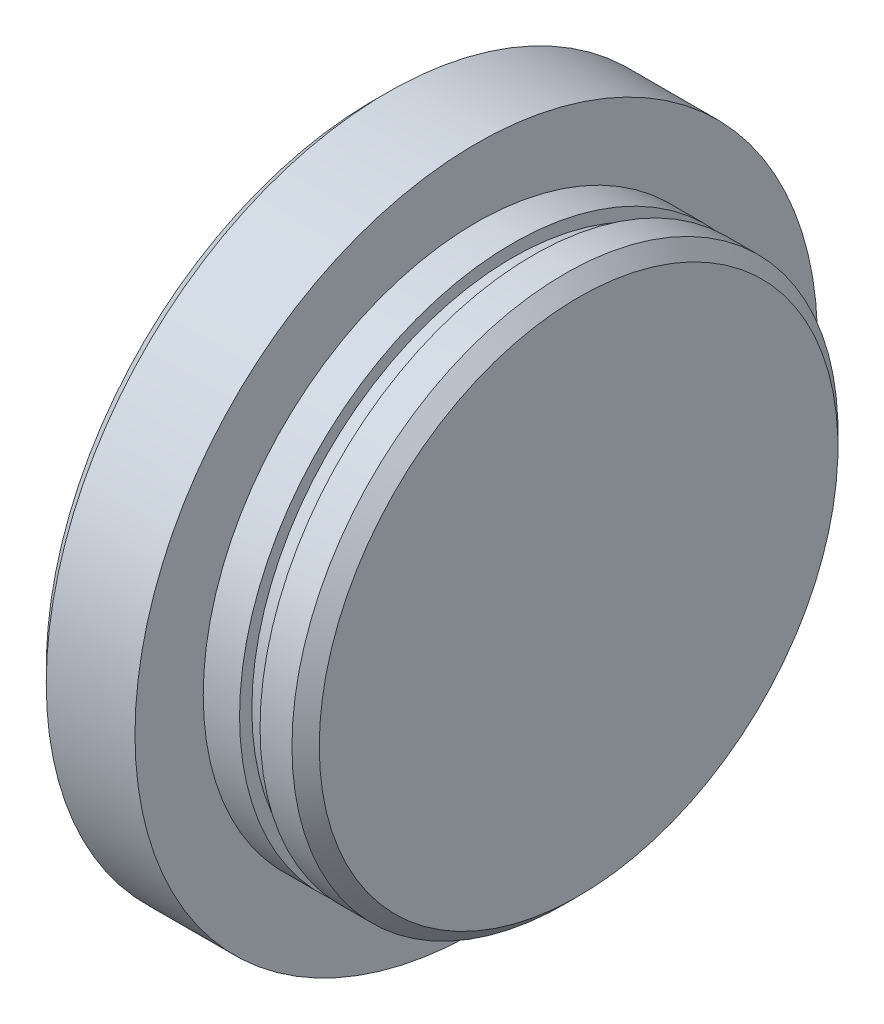
ISO-10303-21;
HEADER;
FILE_DESCRIPTION(('STEP AP214'),'2;1');
FILE_NAME('part.step','',(''),(''),'','','');
FILE_SCHEMA(('AUTOMOTIVE_DESIGN { 1 0 10303 214 1 1 1 1 }'));
ENDSEC;
DATA;
#1=APPLICATION_CONTEXT('core data for automotive mechanical design processes');
#2=APPLICATION_PROTOCOL_DEFINITION('international standard','automotive_design',2000,#1);
#3=PRODUCT_CONTEXT('',#1,'mechanical');
#4=PRODUCT('Part','Part','',(#3));
#5=PRODUCT_RELATED_PRODUCT_CATEGORY('part','',(#4));
#6=PRODUCT_DEFINITION_FORMATION('','',#4);
#7=PRODUCT_DEFINITION_CONTEXT('part definition',#1,'design');
#8=PRODUCT_DEFINITION('design','',#6,#7);
#9=PRODUCT_DEFINITION_SHAPE('','',#8);
#10=(LENGTH_UNIT() NAMED_UNIT(*) SI_UNIT(.MILLI.,.METRE.));
#11=(NAMED_UNIT(*) PLANE_ANGLE_UNIT() SI_UNIT($,.RADIAN.));
#12=(NAMED_UNIT(*) SI_UNIT($,.STERADIAN.) SOLID_ANGLE_UNIT());
#13=UNCERTAINTY_MEASURE_WITH_UNIT(LENGTH_MEASURE(1.E-05),#10,'distance_accuracy_value','');
#14=(GEOMETRIC_REPRESENTATION_CONTEXT(3) GLOBAL_UNCERTAINTY_ASSIGNED_CONTEXT((#13)) GLOBAL_UNIT_ASSIGNED_CONTEXT((#10,
#11,#12)) REPRESENTATION_CONTEXT('',''));
#15=CARTESIAN_POINT('',(0.,0.,0.));
#16=DIRECTION('',(0.,0.,1.));
#17=DIRECTION('',(1.,0.,0.));
#18=AXIS2_PLACEMENT_3D('',#15,#16,#17);
#19=CARTESIAN_POINT('',(0.,0.,0.));
#20=DIRECTION('',(1.,0.,0.));
#21=DIRECTION('',(0.,0.,-1.));
#22=AXIS2_PLACEMENT_3D('',#19,#20,#21);
#23=PLANE('',#22);
#24=CARTESIAN_POINT('',(0.,0.,0.));
#25=DIRECTION('',(1.,0.,0.));
#26=DIRECTION('',(0.,0.,-1.));
#27=AXIS2_PLACEMENT_3D('',#24,#25,#26);
#28=CIRCLE('',#27,48.);
#29=CARTESIAN_POINT('',(0.,0.,-48.));
#30=VERTEX_POINT('',#29);
#31=EDGE_CURVE('E55',#30,#30,#28,.F.);
#32=ORIENTED_EDGE('',*,*,#31,.T.);
#33=EDGE_LOOP('',(#32));
#34=FACE_BOUND('',#33,.T.);
#35=ADVANCED_FACE('F35',(#34),#23,.F.);
#36=CARTESIAN_POINT('',(0.,0.,0.));
#37=DIRECTION('',(-1.,0.,0.));
#38=DIRECTION('',(0.,0.,1.));
#39=AXIS2_PLACEMENT_3D('',#36,#37,#38);
#40=CYLINDRICAL_SURFACE('',#39,50.);
#41=CARTESIAN_POINT('',(2.00000000000002,0.,0.));
#42=DIRECTION('',(1.,0.,0.));
#43=DIRECTION('',(0.,0.,-1.));
#44=AXIS2_PLACEMENT_3D('',#41,#42,#43);
#45=CIRCLE('',#44,50.);
#46=CARTESIAN_POINT('',(2.00000000000002,0.,-50.));
#47=VERTEX_POINT('',#46);
#48=EDGE_CURVE('E49',#47,#47,#45,.T.);
#49=ORIENTED_EDGE('',*,*,#48,.T.);
#50=EDGE_LOOP('',(#49));
#51=FACE_BOUND('',#50,.T.);
#52=CARTESIAN_POINT('',(15.,0.,0.));
#53=DIRECTION('',(-1.,0.,0.));
#54=DIRECTION('',(0.,0.,1.));
#55=AXIS2_PLACEMENT_3D('',#52,#53,#54);
#56=CIRCLE('',#55,50.);
#57=CARTESIAN_POINT('',(15.,0.,50.));
#58=VERTEX_POINT('',#57);
#59=EDGE_CURVE('E61',#58,#58,#56,.T.);
#60=ORIENTED_EDGE('',*,*,#59,.T.);
#61=EDGE_LOOP('',(#60));
#62=FACE_BOUND('',#61,.T.);
#63=ADVANCED_FACE('F100',(#51,#62),#40,.T.);
#64=CARTESIAN_POINT('',(15.,50.,0.));
#65=DIRECTION('',(-1.,0.,0.));
#66=DIRECTION('',(0.,0.,1.));
#67=AXIS2_PLACEMENT_3D('',#64,#65,#66);
#68=PLANE('',#67);
#69=ORIENTED_EDGE('',*,*,#59,.F.);
#70=EDGE_LOOP('',(#69));
#71=FACE_BOUND('',#70,.T.);
#72=CARTESIAN_POINT('',(15.,0.,0.));
#73=DIRECTION('',(-1.,0.,0.));
#74=DIRECTION('',(0.,0.,1.));
#75=AXIS2_PLACEMENT_3D('',#72,#73,#74);
#76=CIRCLE('',#75,40.);
#77=CARTESIAN_POINT('',(15.,0.,40.));
#78=VERTEX_POINT('',#77);
#79=EDGE_CURVE('E64',#78,#78,#76,.T.);
#80=ORIENTED_EDGE('',*,*,#79,.T.);
#81=EDGE_LOOP('',(#80));
#82=FACE_BOUND('',#81,.T.);
#83=ADVANCED_FACE('F106',(#71,#82),#68,.F.);
#84=CARTESIAN_POINT('',(0.,0.,0.));
#85=DIRECTION('',(-1.,0.,0.));
#86=DIRECTION('',(0.,0.,1.));
#87=AXIS2_PLACEMENT_3D('',#84,#85,#86);
#88=CYLINDRICAL_SURFACE('',#87,40.);
#89=ORIENTED_EDGE('',*,*,#79,.F.);
#90=EDGE_LOOP('',(#89));
#91=FACE_BOUND('',#90,.T.);
#92=CARTESIAN_POINT('',(20.3221141740642,0.,0.));
#93=DIRECTION('',(-1.,0.,0.));
#94=DIRECTION('',(0.,0.,1.));
#95=AXIS2_PLACEMENT_3D('',#92,#93,#94);
#96=CIRCLE('',#95,40.);
#97=CARTESIAN_POINT('',(20.3221141740642,0.,40.));
#98=VERTEX_POINT('',#97);
#99=EDGE_CURVE('E68',#98,#98,#96,.T.);
#100=ORIENTED_EDGE('',*,*,#99,.T.);
#101=EDGE_LOOP('',(#100));
#102=FACE_BOUND('',#101,.T.);
#103=ADVANCED_FACE('F124',(#91,#102),#88,.T.);
#104=CARTESIAN_POINT('',(20.3221141740642,40.,0.));
#105=DIRECTION('',(-1.,0.,0.));
#106=DIRECTION('',(0.,0.,1.));
#107=AXIS2_PLACEMENT_3D('',#104,#105,#106);
#108=PLANE('',#107);
#109=ORIENTED_EDGE('',*,*,#99,.F.);
#110=EDGE_LOOP('',(#109));
#111=FACE_BOUND('',#110,.T.);
#112=CARTESIAN_POINT('',(20.3221141740642,0.,0.));
#113=DIRECTION('',(-1.,0.,0.));
#114=DIRECTION('',(0.,0.,1.));
#115=AXIS2_PLACEMENT_3D('',#112,#113,#114);
#116=CIRCLE('',#115,38.2);
#117=CARTESIAN_POINT('',(20.3221141740642,0.,38.2));
#118=VERTEX_POINT('',#117);
#119=EDGE_CURVE('E72',#118,#118,#116,.T.);
#120=ORIENTED_EDGE('',*,*,#119,.T.);
#121=EDGE_LOOP('',(#120));
#122=FACE_BOUND('',#121,.T.);
#123=ADVANCED_FACE('F129',(#111,#122),#108,.F.);
#124=CARTESIAN_POINT('',(0.,0.,0.));
#125=DIRECTION('',(-1.,0.,0.));
#126=DIRECTION('',(0.,0.,1.));
#127=AXIS2_PLACEMENT_3D('',#124,#125,#126);
#128=CYLINDRICAL_SURFACE('',#127,38.2);
#129=ORIENTED_EDGE('',*,*,#119,.F.);
#130=EDGE_LOOP('',(#129));
#131=FACE_BOUND('',#130,.T.);
#132=CARTESIAN_POINT('',(23.3221141740642,0.,0.));
#133=DIRECTION('',(-1.,0.,0.));
#134=DIRECTION('',(0.,0.,1.));
#135=AXIS2_PLACEMENT_3D('',#132,#133,#134);
#136=CIRCLE('',#135,38.2);
#137=CARTESIAN_POINT('',(23.3221141740642,0.,38.2));
#138=VERTEX_POINT('',#137);
#139=EDGE_CURVE('E76',#138,#138,#136,.T.);
#140=ORIENTED_EDGE('',*,*,#139,.T.);
#141=EDGE_LOOP('',(#140));
#142=FACE_BOUND('',#141,.T.);
#143=ADVANCED_FACE('F96',(#131,#142),#128,.T.);
#144=CARTESIAN_POINT('',(23.3221141740642,38.2,0.));
#145=DIRECTION('',(1.,0.,0.));
#146=DIRECTION('',(0.,0.,-1.));
#147=AXIS2_PLACEMENT_3D('',#144,#145,#146);
#148=PLANE('',#147);
#149=ORIENTED_EDGE('',*,*,#139,.F.);
#150=EDGE_LOOP('',(#149));
#151=FACE_BOUND('',#150,.T.);
#152=CARTESIAN_POINT('',(23.3221141740642,0.,0.));
#153=DIRECTION('',(-1.,0.,0.));
#154=DIRECTION('',(0.,0.,1.));
#155=AXIS2_PLACEMENT_3D('',#152,#153,#154);
#156=CIRCLE('',#155,40.);
#157=CARTESIAN_POINT('',(23.3221141740642,0.,40.));
#158=VERTEX_POINT('',#157);
#159=EDGE_CURVE('E79',#158,#158,#156,.T.);
#160=ORIENTED_EDGE('',*,*,#159,.T.);
#161=EDGE_LOOP('',(#160));
#162=FACE_BOUND('',#161,.T.);
#163=ADVANCED_FACE('F84',(#151,#162),#148,.F.);
#164=CARTESIAN_POINT('',(0.,0.,0.));
#165=DIRECTION('',(-1.,0.,0.));
#166=DIRECTION('',(0.,0.,1.));
#167=AXIS2_PLACEMENT_3D('',#164,#165,#166);
#168=CYLINDRICAL_SURFACE('',#167,40.);
#169=CARTESIAN_POINT('',(28.,0.,0.));
#170=DIRECTION('',(-1.,0.,0.));
#171=DIRECTION('',(0.,0.,1.));
#172=AXIS2_PLACEMENT_3D('',#169,#170,#171);
#173=CIRCLE('',#172,40.);
#174=CARTESIAN_POINT('',(28.,0.,40.));
#175=VERTEX_POINT('',#174);
#176=EDGE_CURVE('E43',#175,#175,#173,.T.);
#177=ORIENTED_EDGE('',*,*,#176,.T.);
#178=EDGE_LOOP('',(#177));
#179=FACE_BOUND('',#178,.T.);
#180=ORIENTED_EDGE('',*,*,#159,.F.);
#181=EDGE_LOOP('',(#180));
#182=FACE_BOUND('',#181,.T.);
#183=ADVANCED_FACE('F86',(#179,#182),#168,.T.);
#184=CARTESIAN_POINT('',(30.,40.,0.));
#185=DIRECTION('',(-1.,0.,0.));
#186=DIRECTION('',(0.,0.,1.));
#187=AXIS2_PLACEMENT_3D('',#184,#185,#186);
#188=PLANE('',#187);
#189=CARTESIAN_POINT('',(30.,0.,0.));
#190=DIRECTION('',(-1.,0.,0.));
#191=DIRECTION('',(0.,0.,1.));
#192=AXIS2_PLACEMENT_3D('',#189,#190,#191);
#193=CIRCLE('',#192,38.);
#194=CARTESIAN_POINT('',(30.,0.,38.));
#195=VERTEX_POINT('',#194);
#196=EDGE_CURVE('E10',#195,#195,#193,.F.);
#197=ORIENTED_EDGE('',*,*,#196,.T.);
#198=EDGE_LOOP('',(#197));
#199=FACE_BOUND('',#198,.T.);
#200=ADVANCED_FACE('F88',(#199),#188,.F.);
#201=CARTESIAN_POINT('',(0.,0.,0.));
#202=DIRECTION('',(1.,0.,0.));
#203=DIRECTION('',(0.,0.,-1.));
#204=AXIS2_PLACEMENT_3D('',#201,#202,#203);
#205=CONICAL_SURFACE('',#204,48.,0.785398163397447);
#206=ORIENTED_EDGE('',*,*,#48,.F.);
#207=EDGE_LOOP('',(#206));
#208=FACE_BOUND('',#207,.T.);
#209=ORIENTED_EDGE('',*,*,#31,.F.);
#210=EDGE_LOOP('',(#209));
#211=FACE_BOUND('',#210,.T.);
#212=ADVANCED_FACE('F94',(#208,#211),#205,.T.);
#213=CARTESIAN_POINT('',(28.,0.,0.));
#214=DIRECTION('',(-1.,0.,0.));
#215=DIRECTION('',(0.,0.,1.));
#216=AXIS2_PLACEMENT_3D('',#213,#214,#215);
#217=CONICAL_SURFACE('',#216,40.,0.785398163397452);
#218=ORIENTED_EDGE('',*,*,#196,.F.);
#219=EDGE_LOOP('',(#218));
#220=FACE_BOUND('',#219,.T.);
#221=ORIENTED_EDGE('',*,*,#176,.F.);
#222=EDGE_LOOP('',(#221));
#223=FACE_BOUND('',#222,.T.);
#224=ADVANCED_FACE('F37',(#220,#223),#217,.T.);
#225=CLOSED_SHELL('',(#35,#63,#83,#103,#123,#143,#163,#183,#200,#212,#224));
#226=MANIFOLD_SOLID_BREP('B2',#225);
#227=ADVANCED_BREP_SHAPE_REPRESENTATION('',(#18,#226),#14);
#228=SHAPE_DEFINITION_REPRESENTATION(#9,#227);
ENDSEC;
END-ISO-10303-21;
